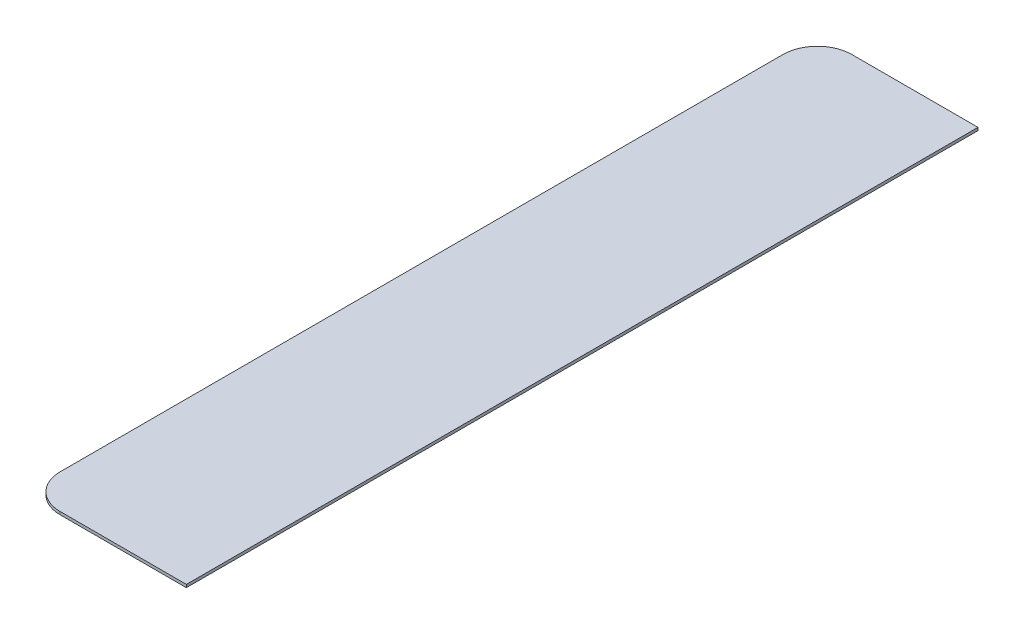
ISO-10303-21;
HEADER;
FILE_DESCRIPTION(('STEP AP214'),'2;1');
FILE_NAME('part.step','',(''),(''),'','','');
FILE_SCHEMA(('AUTOMOTIVE_DESIGN { 1 0 10303 214 1 1 1 1 }'));
ENDSEC;
DATA;
#1=APPLICATION_CONTEXT('core data for automotive mechanical design processes');
#2=APPLICATION_PROTOCOL_DEFINITION('international standard','automotive_design',2000,#1);
#3=PRODUCT_CONTEXT('',#1,'mechanical');
#4=PRODUCT('Part','Part','',(#3));
#5=PRODUCT_RELATED_PRODUCT_CATEGORY('part','',(#4));
#6=PRODUCT_DEFINITION_FORMATION('','',#4);
#7=PRODUCT_DEFINITION_CONTEXT('part definition',#1,'design');
#8=PRODUCT_DEFINITION('design','',#6,#7);
#9=PRODUCT_DEFINITION_SHAPE('','',#8);
#10=(LENGTH_UNIT() NAMED_UNIT(*) SI_UNIT(.MILLI.,.METRE.));
#11=(NAMED_UNIT(*) PLANE_ANGLE_UNIT() SI_UNIT($,.RADIAN.));
#12=(NAMED_UNIT(*) SI_UNIT($,.STERADIAN.) SOLID_ANGLE_UNIT());
#13=UNCERTAINTY_MEASURE_WITH_UNIT(LENGTH_MEASURE(1.E-05),#10,'distance_accuracy_value','');
#14=(GEOMETRIC_REPRESENTATION_CONTEXT(3) GLOBAL_UNCERTAINTY_ASSIGNED_CONTEXT((#13)) GLOBAL_UNIT_ASSIGNED_CONTEXT((#10,
#11,#12)) REPRESENTATION_CONTEXT('',''));
#15=CARTESIAN_POINT('',(0.,0.,0.));
#16=DIRECTION('',(0.,0.,1.));
#17=DIRECTION('',(1.,0.,0.));
#18=AXIS2_PLACEMENT_3D('',#15,#16,#17);
#19=CARTESIAN_POINT('',(0.,6.35,0.));
#20=DIRECTION('',(-1.,0.,0.));
#21=DIRECTION('',(0.,0.,1.));
#22=AXIS2_PLACEMENT_3D('',#19,#20,#21);
#23=PLANE('',#22);
#24=DIRECTION('',(0.,0.,-1.));
#25=VECTOR('',#24,1.);
#26=CARTESIAN_POINT('',(0.,0.,0.));
#27=LINE('',#26,#25);
#28=CARTESIAN_POINT('',(2.14631598018565E-13,0.,1752.6));
#29=VERTEX_POINT('',#28);
#30=CARTESIAN_POINT('',(0.,0.,0.));
#31=VERTEX_POINT('',#30);
#32=EDGE_CURVE('E118',#29,#31,#27,.T.);
#33=ORIENTED_EDGE('',*,*,#32,.T.);
#34=DIRECTION('',(0.,-1.,0.));
#35=VECTOR('',#34,1.);
#36=CARTESIAN_POINT('',(0.,6.35,0.));
#37=LINE('',#36,#35);
#38=CARTESIAN_POINT('',(0.,6.35,0.));
#39=VERTEX_POINT('',#38);
#40=EDGE_CURVE('E11',#39,#31,#37,.T.);
#41=ORIENTED_EDGE('',*,*,#40,.F.);
#42=DIRECTION('',(0.,0.,-1.));
#43=VECTOR('',#42,1.);
#44=CARTESIAN_POINT('',(0.,6.35,0.));
#45=LINE('',#44,#43);
#46=CARTESIAN_POINT('',(2.14631598018565E-13,6.35,1752.6));
#47=VERTEX_POINT('',#46);
#48=EDGE_CURVE('E128',#47,#39,#45,.T.);
#49=ORIENTED_EDGE('',*,*,#48,.F.);
#50=DIRECTION('',(0.,-1.,0.));
#51=VECTOR('',#50,1.);
#52=CARTESIAN_POINT('',(2.14631598018565E-13,6.35,1752.6));
#53=LINE('',#52,#51);
#54=EDGE_CURVE('E114',#47,#29,#53,.T.);
#55=ORIENTED_EDGE('',*,*,#54,.T.);
#56=EDGE_LOOP('',(#33,#41,#49,#55));
#57=FACE_BOUND('',#56,.T.);
#58=ADVANCED_FACE('F34',(#57),#23,.F.);
#59=CARTESIAN_POINT('',(0.,6.35,0.));
#60=DIRECTION('',(0.,0.,1.));
#61=DIRECTION('',(1.,0.,0.));
#62=AXIS2_PLACEMENT_3D('',#59,#60,#61);
#63=PLANE('',#62);
#64=DIRECTION('',(-1.,0.,0.));
#65=VECTOR('',#64,1.);
#66=CARTESIAN_POINT('',(0.,0.,0.));
#67=LINE('',#66,#65);
#68=CARTESIAN_POINT('',(-279.399999999999,0.,0.));
#69=VERTEX_POINT('',#68);
#70=EDGE_CURVE('E121',#31,#69,#67,.T.);
#71=ORIENTED_EDGE('',*,*,#70,.T.);
#72=DIRECTION('',(0.,-1.,0.));
#73=VECTOR('',#72,1.);
#74=CARTESIAN_POINT('',(-279.399999999999,6.35,0.));
#75=LINE('',#74,#73);
#76=CARTESIAN_POINT('',(-279.399999999999,6.35,0.));
#77=VERTEX_POINT('',#76);
#78=EDGE_CURVE('E42',#77,#69,#75,.T.);
#79=ORIENTED_EDGE('',*,*,#78,.F.);
#80=DIRECTION('',(-1.,0.,0.));
#81=VECTOR('',#80,1.);
#82=CARTESIAN_POINT('',(0.,6.35,0.));
#83=LINE('',#82,#81);
#84=EDGE_CURVE('E87',#39,#77,#83,.T.);
#85=ORIENTED_EDGE('',*,*,#84,.F.);
#86=ORIENTED_EDGE('',*,*,#40,.T.);
#87=EDGE_LOOP('',(#71,#79,#85,#86));
#88=FACE_BOUND('',#87,.T.);
#89=ADVANCED_FACE('F152',(#88),#63,.F.);
#90=CARTESIAN_POINT('',(-279.4,6.35,76.2));
#91=DIRECTION('',(0.,-1.,0.));
#92=DIRECTION('',(0.,0.,-1.));
#93=AXIS2_PLACEMENT_3D('',#90,#91,#92);
#94=CYLINDRICAL_SURFACE('',#93,76.2);
#95=CARTESIAN_POINT('',(-279.4,0.,76.2));
#96=DIRECTION('',(0.,1.,0.));
#97=DIRECTION('',(0.,0.,-1.));
#98=AXIS2_PLACEMENT_3D('',#95,#96,#97);
#99=CIRCLE('',#98,76.2);
#100=CARTESIAN_POINT('',(-355.6,0.,76.2000000000006));
#101=VERTEX_POINT('',#100);
#102=EDGE_CURVE('E123',#69,#101,#99,.T.);
#103=ORIENTED_EDGE('',*,*,#102,.T.);
#104=DIRECTION('',(0.,-1.,0.));
#105=VECTOR('',#104,1.);
#106=CARTESIAN_POINT('',(-355.6,6.35,76.2000000000006));
#107=LINE('',#106,#105);
#108=CARTESIAN_POINT('',(-355.6,6.35,76.2000000000006));
#109=VERTEX_POINT('',#108);
#110=EDGE_CURVE('E109',#109,#101,#107,.T.);
#111=ORIENTED_EDGE('',*,*,#110,.F.);
#112=CARTESIAN_POINT('',(-279.4,6.35,76.2));
#113=DIRECTION('',(0.,1.,0.));
#114=DIRECTION('',(0.,0.,-1.));
#115=AXIS2_PLACEMENT_3D('',#112,#113,#114);
#116=CIRCLE('',#115,76.2);
#117=EDGE_CURVE('E100',#77,#109,#116,.T.);
#118=ORIENTED_EDGE('',*,*,#117,.F.);
#119=ORIENTED_EDGE('',*,*,#78,.T.);
#120=EDGE_LOOP('',(#103,#111,#118,#119));
#121=FACE_BOUND('',#120,.T.);
#122=ADVANCED_FACE('F134',(#121),#94,.T.);
#123=CARTESIAN_POINT('',(-355.6,6.35,76.2000000000006));
#124=DIRECTION('',(1.,0.,0.));
#125=DIRECTION('',(0.,0.,-1.));
#126=AXIS2_PLACEMENT_3D('',#123,#124,#125);
#127=PLANE('',#126);
#128=DIRECTION('',(0.,0.,1.));
#129=VECTOR('',#128,1.);
#130=CARTESIAN_POINT('',(-355.6,0.,76.2000000000006));
#131=LINE('',#130,#129);
#132=CARTESIAN_POINT('',(-355.6,0.,1676.4));
#133=VERTEX_POINT('',#132);
#134=EDGE_CURVE('E108',#101,#133,#131,.T.);
#135=ORIENTED_EDGE('',*,*,#134,.T.);
#136=DIRECTION('',(0.,-1.,0.));
#137=VECTOR('',#136,1.);
#138=CARTESIAN_POINT('',(-355.6,6.35,1676.4));
#139=LINE('',#138,#137);
#140=CARTESIAN_POINT('',(-355.6,6.35,1676.4));
#141=VERTEX_POINT('',#140);
#142=EDGE_CURVE('E105',#141,#133,#139,.T.);
#143=ORIENTED_EDGE('',*,*,#142,.F.);
#144=DIRECTION('',(0.,0.,1.));
#145=VECTOR('',#144,1.);
#146=CARTESIAN_POINT('',(-355.6,6.35,76.2000000000006));
#147=LINE('',#146,#145);
#148=EDGE_CURVE('E94',#109,#141,#147,.T.);
#149=ORIENTED_EDGE('',*,*,#148,.F.);
#150=ORIENTED_EDGE('',*,*,#110,.T.);
#151=EDGE_LOOP('',(#135,#143,#149,#150));
#152=FACE_BOUND('',#151,.T.);
#153=ADVANCED_FACE('F106',(#152),#127,.F.);
#154=CARTESIAN_POINT('',(-279.4,6.35,1676.4));
#155=DIRECTION('',(0.,-1.,0.));
#156=DIRECTION('',(0.,0.,-1.));
#157=AXIS2_PLACEMENT_3D('',#154,#155,#156);
#158=CYLINDRICAL_SURFACE('',#157,76.2);
#159=CARTESIAN_POINT('',(-279.4,0.,1676.4));
#160=DIRECTION('',(0.,1.,0.));
#161=DIRECTION('',(0.,0.,1.));
#162=AXIS2_PLACEMENT_3D('',#159,#160,#161);
#163=CIRCLE('',#162,76.2);
#164=CARTESIAN_POINT('',(-279.4,0.,1752.6));
#165=VERTEX_POINT('',#164);
#166=EDGE_CURVE('E73',#133,#165,#163,.T.);
#167=ORIENTED_EDGE('',*,*,#166,.T.);
#168=DIRECTION('',(0.,-1.,0.));
#169=VECTOR('',#168,1.);
#170=CARTESIAN_POINT('',(-279.4,6.35,1752.6));
#171=LINE('',#170,#169);
#172=CARTESIAN_POINT('',(-279.4,6.35,1752.6));
#173=VERTEX_POINT('',#172);
#174=EDGE_CURVE('E110',#173,#165,#171,.T.);
#175=ORIENTED_EDGE('',*,*,#174,.F.);
#176=CARTESIAN_POINT('',(-279.4,6.35,1676.4));
#177=DIRECTION('',(0.,1.,0.));
#178=DIRECTION('',(0.,0.,1.));
#179=AXIS2_PLACEMENT_3D('',#176,#177,#178);
#180=CIRCLE('',#179,76.2);
#181=EDGE_CURVE('E98',#141,#173,#180,.T.);
#182=ORIENTED_EDGE('',*,*,#181,.F.);
#183=ORIENTED_EDGE('',*,*,#142,.T.);
#184=EDGE_LOOP('',(#167,#175,#182,#183));
#185=FACE_BOUND('',#184,.T.);
#186=ADVANCED_FACE('F112',(#185),#158,.T.);
#187=CARTESIAN_POINT('',(2.14631598018565E-13,6.35,1752.6));
#188=DIRECTION('',(0.,0.,-1.));
#189=DIRECTION('',(-1.,0.,0.));
#190=AXIS2_PLACEMENT_3D('',#187,#188,#189);
#191=PLANE('',#190);
#192=DIRECTION('',(1.,0.,0.));
#193=VECTOR('',#192,1.);
#194=CARTESIAN_POINT('',(2.14631598018565E-13,0.,1752.6));
#195=LINE('',#194,#193);
#196=EDGE_CURVE('E79',#165,#29,#195,.T.);
#197=ORIENTED_EDGE('',*,*,#196,.T.);
#198=ORIENTED_EDGE('',*,*,#54,.F.);
#199=DIRECTION('',(1.,0.,0.));
#200=VECTOR('',#199,1.);
#201=CARTESIAN_POINT('',(2.14631598018565E-13,6.35,1752.6));
#202=LINE('',#201,#200);
#203=EDGE_CURVE('E50',#173,#47,#202,.T.);
#204=ORIENTED_EDGE('',*,*,#203,.F.);
#205=ORIENTED_EDGE('',*,*,#174,.T.);
#206=EDGE_LOOP('',(#197,#198,#204,#205));
#207=FACE_BOUND('',#206,.T.);
#208=ADVANCED_FACE('F141',(#207),#191,.F.);
#209=CARTESIAN_POINT('',(-279.4,6.35,1676.4));
#210=DIRECTION('',(0.,1.,0.));
#211=DIRECTION('',(0.,0.,1.));
#212=AXIS2_PLACEMENT_3D('',#209,#210,#211);
#213=PLANE('',#212);
#214=ORIENTED_EDGE('',*,*,#48,.T.);
#215=ORIENTED_EDGE('',*,*,#84,.T.);
#216=ORIENTED_EDGE('',*,*,#117,.T.);
#217=ORIENTED_EDGE('',*,*,#148,.T.);
#218=ORIENTED_EDGE('',*,*,#181,.T.);
#219=ORIENTED_EDGE('',*,*,#203,.T.);
#220=EDGE_LOOP('',(#214,#215,#216,#217,#218,#219));
#221=FACE_BOUND('',#220,.T.);
#222=ADVANCED_FACE('F96',(#221),#213,.T.);
#223=CARTESIAN_POINT('',(-279.4,0.,1676.4));
#224=DIRECTION('',(0.,1.,0.));
#225=DIRECTION('',(0.,0.,1.));
#226=AXIS2_PLACEMENT_3D('',#223,#224,#225);
#227=PLANE('',#226);
#228=ORIENTED_EDGE('',*,*,#32,.F.);
#229=ORIENTED_EDGE('',*,*,#196,.F.);
#230=ORIENTED_EDGE('',*,*,#166,.F.);
#231=ORIENTED_EDGE('',*,*,#134,.F.);
#232=ORIENTED_EDGE('',*,*,#102,.F.);
#233=ORIENTED_EDGE('',*,*,#70,.F.);
#234=EDGE_LOOP('',(#228,#229,#230,#231,#232,#233));
#235=FACE_BOUND('',#234,.T.);
#236=ADVANCED_FACE('F137',(#235),#227,.F.);
#237=CLOSED_SHELL('',(#58,#89,#122,#153,#186,#208,#222,#236));
#238=MANIFOLD_SOLID_BREP('B2',#237);
#239=ADVANCED_BREP_SHAPE_REPRESENTATION('',(#18,#238),#14);
#240=SHAPE_DEFINITION_REPRESENTATION(#9,#239);
ENDSEC;
END-ISO-10303-21;
